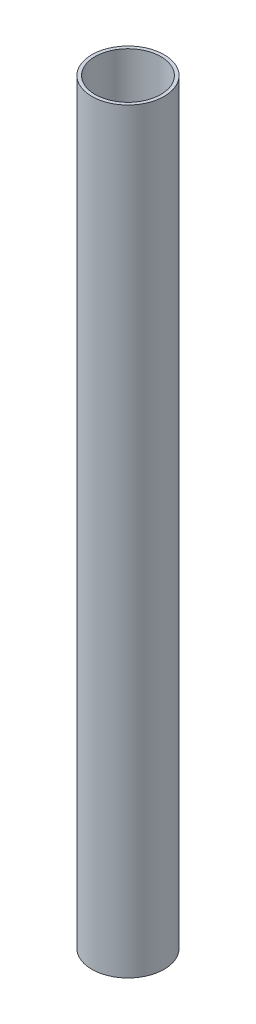
ISO-10303-21;
HEADER;
FILE_DESCRIPTION(('STEP AP214'),'2;1');
FILE_NAME('part.step','',(''),(''),'','','');
FILE_SCHEMA(('AUTOMOTIVE_DESIGN { 1 0 10303 214 1 1 1 1 }'));
ENDSEC;
DATA;
#1=APPLICATION_CONTEXT('core data for automotive mechanical design processes');
#2=APPLICATION_PROTOCOL_DEFINITION('international standard','automotive_design',2000,#1);
#3=PRODUCT_CONTEXT('',#1,'mechanical');
#4=PRODUCT('Part','Part','',(#3));
#5=PRODUCT_RELATED_PRODUCT_CATEGORY('part','',(#4));
#6=PRODUCT_DEFINITION_FORMATION('','',#4);
#7=PRODUCT_DEFINITION_CONTEXT('part definition',#1,'design');
#8=PRODUCT_DEFINITION('design','',#6,#7);
#9=PRODUCT_DEFINITION_SHAPE('','',#8);
#10=(LENGTH_UNIT() NAMED_UNIT(*) SI_UNIT(.MILLI.,.METRE.));
#11=(NAMED_UNIT(*) PLANE_ANGLE_UNIT() SI_UNIT($,.RADIAN.));
#12=(NAMED_UNIT(*) SI_UNIT($,.STERADIAN.) SOLID_ANGLE_UNIT());
#13=UNCERTAINTY_MEASURE_WITH_UNIT(LENGTH_MEASURE(1.E-05),#10,'distance_accuracy_value','');
#14=(GEOMETRIC_REPRESENTATION_CONTEXT(3) GLOBAL_UNCERTAINTY_ASSIGNED_CONTEXT((#13)) GLOBAL_UNIT_ASSIGNED_CONTEXT((#10,
#11,#12)) REPRESENTATION_CONTEXT('',''));
#15=CARTESIAN_POINT('',(0.,0.,0.));
#16=DIRECTION('',(0.,0.,1.));
#17=DIRECTION('',(1.,0.,0.));
#18=AXIS2_PLACEMENT_3D('',#15,#16,#17);
#19=CARTESIAN_POINT('',(0.,230.,0.));
#20=DIRECTION('',(0.,1.,0.));
#21=DIRECTION('',(0.,0.,1.));
#22=AXIS2_PLACEMENT_3D('',#19,#20,#21);
#23=PLANE('',#22);
#24=CARTESIAN_POINT('',(0.,230.,0.));
#25=DIRECTION('',(0.,1.,0.));
#26=DIRECTION('',(0.,0.,1.));
#27=AXIS2_PLACEMENT_3D('',#24,#25,#26);
#28=CIRCLE('',#27,11.);
#29=CARTESIAN_POINT('',(0.,230.,11.));
#30=VERTEX_POINT('',#29);
#31=EDGE_CURVE('E10',#30,#30,#28,.T.);
#32=ORIENTED_EDGE('',*,*,#31,.T.);
#33=EDGE_LOOP('',(#32));
#34=FACE_BOUND('',#33,.T.);
#35=CARTESIAN_POINT('',(0.,230.,0.));
#36=DIRECTION('',(0.,1.,0.));
#37=DIRECTION('',(0.,0.,1.));
#38=AXIS2_PLACEMENT_3D('',#35,#36,#37);
#39=CIRCLE('',#38,10.);
#40=CARTESIAN_POINT('',(0.,230.,10.));
#41=VERTEX_POINT('',#40);
#42=EDGE_CURVE('E44',#41,#41,#39,.T.);
#43=ORIENTED_EDGE('',*,*,#42,.F.);
#44=EDGE_LOOP('',(#43));
#45=FACE_BOUND('',#44,.T.);
#46=ADVANCED_FACE('F33',(#34,#45),#23,.T.);
#47=CARTESIAN_POINT('',(0.,0.,0.));
#48=DIRECTION('',(0.,1.,0.));
#49=DIRECTION('',(0.,0.,1.));
#50=AXIS2_PLACEMENT_3D('',#47,#48,#49);
#51=PLANE('',#50);
#52=CARTESIAN_POINT('',(0.,0.,0.));
#53=DIRECTION('',(0.,1.,0.));
#54=DIRECTION('',(0.,0.,1.));
#55=AXIS2_PLACEMENT_3D('',#52,#53,#54);
#56=CIRCLE('',#55,11.);
#57=CARTESIAN_POINT('',(0.,0.,11.));
#58=VERTEX_POINT('',#57);
#59=EDGE_CURVE('E37',#58,#58,#56,.T.);
#60=ORIENTED_EDGE('',*,*,#59,.F.);
#61=EDGE_LOOP('',(#60));
#62=FACE_BOUND('',#61,.T.);
#63=CARTESIAN_POINT('',(0.,0.,0.));
#64=DIRECTION('',(0.,1.,0.));
#65=DIRECTION('',(0.,0.,1.));
#66=AXIS2_PLACEMENT_3D('',#63,#64,#65);
#67=CIRCLE('',#66,10.);
#68=CARTESIAN_POINT('',(0.,0.,10.));
#69=VERTEX_POINT('',#68);
#70=EDGE_CURVE('E46',#69,#69,#67,.T.);
#71=ORIENTED_EDGE('',*,*,#70,.T.);
#72=EDGE_LOOP('',(#71));
#73=FACE_BOUND('',#72,.T.);
#74=ADVANCED_FACE('F56',(#62,#73),#51,.F.);
#75=CARTESIAN_POINT('',(0.,230.,0.));
#76=DIRECTION('',(0.,-1.,0.));
#77=DIRECTION('',(0.,0.,-1.));
#78=AXIS2_PLACEMENT_3D('',#75,#76,#77);
#79=CYLINDRICAL_SURFACE('',#78,11.);
#80=ORIENTED_EDGE('',*,*,#31,.F.);
#81=EDGE_LOOP('',(#80));
#82=FACE_BOUND('',#81,.T.);
#83=ORIENTED_EDGE('',*,*,#59,.T.);
#84=EDGE_LOOP('',(#83));
#85=FACE_BOUND('',#84,.T.);
#86=ADVANCED_FACE('F35',(#82,#85),#79,.T.);
#87=CARTESIAN_POINT('',(0.,230.,0.));
#88=DIRECTION('',(0.,-1.,0.));
#89=DIRECTION('',(0.,0.,-1.));
#90=AXIS2_PLACEMENT_3D('',#87,#88,#89);
#91=CYLINDRICAL_SURFACE('',#90,10.);
#92=ORIENTED_EDGE('',*,*,#42,.T.);
#93=EDGE_LOOP('',(#92));
#94=FACE_BOUND('',#93,.T.);
#95=ORIENTED_EDGE('',*,*,#70,.F.);
#96=EDGE_LOOP('',(#95));
#97=FACE_BOUND('',#96,.T.);
#98=ADVANCED_FACE('F52',(#94,#97),#91,.F.);
#99=CLOSED_SHELL('',(#46,#74,#86,#98));
#100=MANIFOLD_SOLID_BREP('B2',#99);
#101=ADVANCED_BREP_SHAPE_REPRESENTATION('',(#18,#100),#14);
#102=SHAPE_DEFINITION_REPRESENTATION(#9,#101);
ENDSEC;
END-ISO-10303-21;
